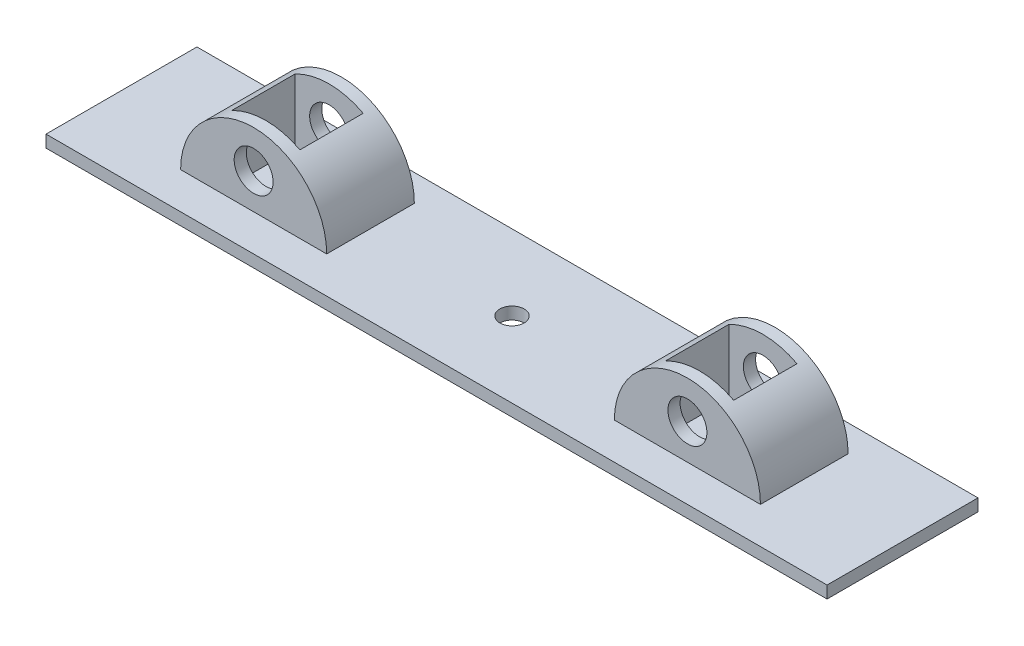
ISO-10303-21;
HEADER;
FILE_DESCRIPTION(('STEP AP214'),'2;1');
FILE_NAME('part.step','',(''),(''),'','','');
FILE_SCHEMA(('AUTOMOTIVE_DESIGN { 1 0 10303 214 1 1 1 1 }'));
ENDSEC;
DATA;
#1=APPLICATION_CONTEXT('core data for automotive mechanical design processes');
#2=APPLICATION_PROTOCOL_DEFINITION('international standard','automotive_design',2000,#1);
#3=PRODUCT_CONTEXT('',#1,'mechanical');
#4=PRODUCT('Part','Part','',(#3));
#5=PRODUCT_RELATED_PRODUCT_CATEGORY('part','',(#4));
#6=PRODUCT_DEFINITION_FORMATION('','',#4);
#7=PRODUCT_DEFINITION_CONTEXT('part definition',#1,'design');
#8=PRODUCT_DEFINITION('design','',#6,#7);
#9=PRODUCT_DEFINITION_SHAPE('','',#8);
#10=(LENGTH_UNIT() NAMED_UNIT(*) SI_UNIT(.MILLI.,.METRE.));
#11=(NAMED_UNIT(*) PLANE_ANGLE_UNIT() SI_UNIT($,.RADIAN.));
#12=(NAMED_UNIT(*) SI_UNIT($,.STERADIAN.) SOLID_ANGLE_UNIT());
#13=UNCERTAINTY_MEASURE_WITH_UNIT(LENGTH_MEASURE(1.E-05),#10,'distance_accuracy_value','');
#14=(GEOMETRIC_REPRESENTATION_CONTEXT(3) GLOBAL_UNCERTAINTY_ASSIGNED_CONTEXT((#13)) GLOBAL_UNIT_ASSIGNED_CONTEXT((#10,
#11,#12)) REPRESENTATION_CONTEXT('',''));
#15=CARTESIAN_POINT('',(0.,0.,0.));
#16=DIRECTION('',(0.,0.,1.));
#17=DIRECTION('',(1.,0.,0.));
#18=AXIS2_PLACEMENT_3D('',#15,#16,#17);
#19=CARTESIAN_POINT('',(35.1428377006438,2.5,-25.5));
#20=DIRECTION('',(0.,0.,1.));
#21=DIRECTION('',(1.,0.,0.));
#22=AXIS2_PLACEMENT_3D('',#19,#20,#21);
#23=CYLINDRICAL_SURFACE('',#22,15.);
#24=CARTESIAN_POINT('',(35.1428377006438,2.5,-7.5));
#25=DIRECTION('',(0.,0.,1.));
#26=DIRECTION('',(1.,0.,0.));
#27=AXIS2_PLACEMENT_3D('',#24,#25,#26);
#28=CIRCLE('',#27,15.);
#29=CARTESIAN_POINT('',(50.1428377006438,2.5,-7.5));
#30=VERTEX_POINT('',#29);
#31=CARTESIAN_POINT('',(20.1428377006438,2.5,-7.5));
#32=VERTEX_POINT('',#31);
#33=EDGE_CURVE('E273',#30,#32,#28,.T.);
#34=ORIENTED_EDGE('',*,*,#33,.F.);
#35=DIRECTION('',(0.,0.,1.));
#36=VECTOR('',#35,1.);
#37=CARTESIAN_POINT('',(50.1428377006438,2.5,-25.5));
#38=LINE('',#37,#36);
#39=CARTESIAN_POINT('',(50.1428377006438,2.5,-25.5));
#40=VERTEX_POINT('',#39);
#41=EDGE_CURVE('E291',#40,#30,#38,.T.);
#42=ORIENTED_EDGE('',*,*,#41,.F.);
#43=CARTESIAN_POINT('',(35.1428377006438,2.5,-25.5));
#44=DIRECTION('',(0.,0.,1.));
#45=DIRECTION('',(1.,0.,0.));
#46=AXIS2_PLACEMENT_3D('',#43,#44,#45);
#47=CIRCLE('',#46,15.);
#48=CARTESIAN_POINT('',(20.1428377006438,2.5,-25.5));
#49=VERTEX_POINT('',#48);
#50=EDGE_CURVE('E277',#40,#49,#47,.T.);
#51=ORIENTED_EDGE('',*,*,#50,.T.);
#52=DIRECTION('',(0.,0.,1.));
#53=VECTOR('',#52,1.);
#54=CARTESIAN_POINT('',(20.1428377006438,2.5,-25.5));
#55=LINE('',#54,#53);
#56=EDGE_CURVE('E285',#49,#32,#55,.T.);
#57=ORIENTED_EDGE('',*,*,#56,.T.);
#58=EDGE_LOOP('',(#34,#42,#51,#57));
#59=FACE_BOUND('',#58,.T.);
#60=CARTESIAN_POINT('',(35.1428377006438,2.5,-10.));
#61=DIRECTION('',(0.,0.,-1.));
#62=DIRECTION('',(-1.,0.,0.));
#63=AXIS2_PLACEMENT_3D('',#60,#61,#62);
#64=CIRCLE('',#63,15.);
#65=CARTESIAN_POINT('',(42.1428377006438,15.7664991614216,-10.));
#66=VERTEX_POINT('',#65);
#67=CARTESIAN_POINT('',(28.1428377006438,15.7664991614216,-10.));
#68=VERTEX_POINT('',#67);
#69=EDGE_CURVE('E235',#66,#68,#64,.F.);
#70=ORIENTED_EDGE('',*,*,#69,.T.);
#71=DIRECTION('',(0.,0.,1.));
#72=VECTOR('',#71,1.);
#73=CARTESIAN_POINT('',(28.1428377006438,15.7664991614216,-25.5));
#74=LINE('',#73,#72);
#75=CARTESIAN_POINT('',(28.1428377006438,15.7664991614216,-23.));
#76=VERTEX_POINT('',#75);
#77=EDGE_CURVE('E11',#68,#76,#74,.F.);
#78=ORIENTED_EDGE('',*,*,#77,.T.);
#79=CARTESIAN_POINT('',(35.1428377006438,2.5,-23.));
#80=DIRECTION('',(0.,0.,1.));
#81=DIRECTION('',(1.,0.,0.));
#82=AXIS2_PLACEMENT_3D('',#79,#80,#81);
#83=CIRCLE('',#82,15.);
#84=CARTESIAN_POINT('',(42.1428377006438,15.7664991614216,-23.));
#85=VERTEX_POINT('',#84);
#86=EDGE_CURVE('E230',#76,#85,#83,.F.);
#87=ORIENTED_EDGE('',*,*,#86,.T.);
#88=DIRECTION('',(0.,0.,1.));
#89=VECTOR('',#88,1.);
#90=CARTESIAN_POINT('',(42.1428377006438,15.7664991614216,-25.5));
#91=LINE('',#90,#89);
#92=EDGE_CURVE('E48',#85,#66,#91,.T.);
#93=ORIENTED_EDGE('',*,*,#92,.T.);
#94=EDGE_LOOP('',(#70,#78,#87,#93));
#95=FACE_BOUND('',#94,.T.);
#96=ADVANCED_FACE('F39',(#59,#95),#23,.T.);
#97=CARTESIAN_POINT('',(35.1428377006438,9.77291933943923,-25.5));
#98=DIRECTION('',(0.,0.,1.));
#99=DIRECTION('',(1.,0.,0.));
#100=AXIS2_PLACEMENT_3D('',#97,#98,#99);
#101=CYLINDRICAL_SURFACE('',#100,4.00000000000001);
#102=CARTESIAN_POINT('',(35.1428377006438,9.77291933943923,-7.5));
#103=DIRECTION('',(0.,0.,1.));
#104=DIRECTION('',(1.,0.,0.));
#105=AXIS2_PLACEMENT_3D('',#102,#103,#104);
#106=CIRCLE('',#105,4.00000000000001);
#107=CARTESIAN_POINT('',(39.1428377006438,9.77291933943923,-7.5));
#108=VERTEX_POINT('',#107);
#109=EDGE_CURVE('E265',#108,#108,#106,.T.);
#110=ORIENTED_EDGE('',*,*,#109,.T.);
#111=EDGE_LOOP('',(#110));
#112=FACE_BOUND('',#111,.T.);
#113=CARTESIAN_POINT('',(35.1428377006438,9.77291933943923,-10.));
#114=DIRECTION('',(0.,0.,-1.));
#115=DIRECTION('',(-1.,0.,0.));
#116=AXIS2_PLACEMENT_3D('',#113,#114,#115);
#117=CIRCLE('',#116,4.00000000000001);
#118=CARTESIAN_POINT('',(31.1428377006438,9.77291933943923,-10.));
#119=VERTEX_POINT('',#118);
#120=EDGE_CURVE('E234',#119,#119,#117,.F.);
#121=ORIENTED_EDGE('',*,*,#120,.F.);
#122=EDGE_LOOP('',(#121));
#123=FACE_BOUND('',#122,.T.);
#124=ADVANCED_FACE('F381',(#112,#123),#101,.F.);
#125=CARTESIAN_POINT('',(35.1428377006438,9.77291933943923,-25.5));
#126=DIRECTION('',(0.,0.,1.));
#127=DIRECTION('',(1.,0.,0.));
#128=AXIS2_PLACEMENT_3D('',#125,#126,#127);
#129=CIRCLE('',#128,4.00000000000001);
#130=CARTESIAN_POINT('',(39.1428377006438,9.77291933943923,-25.5));
#131=VERTEX_POINT('',#130);
#132=EDGE_CURVE('E269',#131,#131,#129,.T.);
#133=ORIENTED_EDGE('',*,*,#132,.F.);
#134=EDGE_LOOP('',(#133));
#135=FACE_BOUND('',#134,.T.);
#136=CARTESIAN_POINT('',(35.1428377006438,9.77291933943923,-23.));
#137=DIRECTION('',(0.,0.,1.));
#138=DIRECTION('',(1.,0.,0.));
#139=AXIS2_PLACEMENT_3D('',#136,#137,#138);
#140=CIRCLE('',#139,4.00000000000001);
#141=CARTESIAN_POINT('',(39.1428377006438,9.77291933943923,-23.));
#142=VERTEX_POINT('',#141);
#143=EDGE_CURVE('E229',#142,#142,#140,.F.);
#144=ORIENTED_EDGE('',*,*,#143,.F.);
#145=EDGE_LOOP('',(#144));
#146=FACE_BOUND('',#145,.T.);
#147=ADVANCED_FACE('F378',(#135,#146),#101,.F.);
#148=CARTESIAN_POINT('',(124.223811869943,2.5,-25.5));
#149=DIRECTION('',(0.,0.,1.));
#150=DIRECTION('',(1.,0.,0.));
#151=AXIS2_PLACEMENT_3D('',#148,#149,#150);
#152=CYLINDRICAL_SURFACE('',#151,15.);
#153=CARTESIAN_POINT('',(124.223811869943,2.5,-7.5));
#154=DIRECTION('',(0.,0.,1.));
#155=DIRECTION('',(1.,0.,0.));
#156=AXIS2_PLACEMENT_3D('',#153,#154,#155);
#157=CIRCLE('',#156,15.);
#158=CARTESIAN_POINT('',(139.223811869943,2.5,-7.5));
#159=VERTEX_POINT('',#158);
#160=CARTESIAN_POINT('',(109.223811869943,2.5,-7.5));
#161=VERTEX_POINT('',#160);
#162=EDGE_CURVE('E243',#159,#161,#157,.T.);
#163=ORIENTED_EDGE('',*,*,#162,.F.);
#164=DIRECTION('',(0.,0.,1.));
#165=VECTOR('',#164,1.);
#166=CARTESIAN_POINT('',(139.223811869943,2.5,-25.5));
#167=LINE('',#166,#165);
#168=CARTESIAN_POINT('',(139.223811869943,2.5,-25.5));
#169=VERTEX_POINT('',#168);
#170=EDGE_CURVE('E261',#169,#159,#167,.T.);
#171=ORIENTED_EDGE('',*,*,#170,.F.);
#172=CARTESIAN_POINT('',(124.223811869943,2.5,-25.5));
#173=DIRECTION('',(0.,0.,1.));
#174=DIRECTION('',(1.,0.,0.));
#175=AXIS2_PLACEMENT_3D('',#172,#173,#174);
#176=CIRCLE('',#175,15.);
#177=CARTESIAN_POINT('',(109.223811869943,2.5,-25.5));
#178=VERTEX_POINT('',#177);
#179=EDGE_CURVE('E247',#169,#178,#176,.T.);
#180=ORIENTED_EDGE('',*,*,#179,.T.);
#181=DIRECTION('',(0.,0.,1.));
#182=VECTOR('',#181,1.);
#183=CARTESIAN_POINT('',(109.223811869943,2.5,-25.5));
#184=LINE('',#183,#182);
#185=EDGE_CURVE('E255',#178,#161,#184,.T.);
#186=ORIENTED_EDGE('',*,*,#185,.T.);
#187=EDGE_LOOP('',(#163,#171,#180,#186));
#188=FACE_BOUND('',#187,.T.);
#189=CARTESIAN_POINT('',(124.223811869943,2.5,-10.));
#190=DIRECTION('',(0.,0.,-1.));
#191=DIRECTION('',(-1.,0.,0.));
#192=AXIS2_PLACEMENT_3D('',#189,#190,#191);
#193=CIRCLE('',#192,15.);
#194=CARTESIAN_POINT('',(131.223811869943,15.7664991614216,-10.));
#195=VERTEX_POINT('',#194);
#196=CARTESIAN_POINT('',(117.223811869943,15.7664991614216,-10.));
#197=VERTEX_POINT('',#196);
#198=EDGE_CURVE('E225',#195,#197,#193,.F.);
#199=ORIENTED_EDGE('',*,*,#198,.T.);
#200=DIRECTION('',(0.,0.,1.));
#201=VECTOR('',#200,1.);
#202=CARTESIAN_POINT('',(117.223811869943,15.7664991614216,-25.5));
#203=LINE('',#202,#201);
#204=CARTESIAN_POINT('',(117.223811869943,15.7664991614216,-23.));
#205=VERTEX_POINT('',#204);
#206=EDGE_CURVE('E358',#197,#205,#203,.F.);
#207=ORIENTED_EDGE('',*,*,#206,.T.);
#208=CARTESIAN_POINT('',(124.223811869943,2.5,-23.));
#209=DIRECTION('',(0.,0.,1.));
#210=DIRECTION('',(1.,0.,0.));
#211=AXIS2_PLACEMENT_3D('',#208,#209,#210);
#212=CIRCLE('',#211,15.);
#213=CARTESIAN_POINT('',(131.223811869943,15.7664991614216,-23.));
#214=VERTEX_POINT('',#213);
#215=EDGE_CURVE('E220',#205,#214,#212,.F.);
#216=ORIENTED_EDGE('',*,*,#215,.T.);
#217=DIRECTION('',(0.,0.,1.));
#218=VECTOR('',#217,1.);
#219=CARTESIAN_POINT('',(131.223811869943,15.7664991614216,-25.5));
#220=LINE('',#219,#218);
#221=EDGE_CURVE('E348',#214,#195,#220,.T.);
#222=ORIENTED_EDGE('',*,*,#221,.T.);
#223=EDGE_LOOP('',(#199,#207,#216,#222));
#224=FACE_BOUND('',#223,.T.);
#225=ADVANCED_FACE('F380',(#188,#224),#152,.T.);
#226=CARTESIAN_POINT('',(124.223811869943,9.77291933943923,-25.5));
#227=DIRECTION('',(0.,0.,1.));
#228=DIRECTION('',(1.,0.,0.));
#229=AXIS2_PLACEMENT_3D('',#226,#227,#228);
#230=CYLINDRICAL_SURFACE('',#229,3.99999999999998);
#231=CARTESIAN_POINT('',(124.223811869943,9.77291933943923,-7.5));
#232=DIRECTION('',(0.,0.,1.));
#233=DIRECTION('',(1.,0.,0.));
#234=AXIS2_PLACEMENT_3D('',#231,#232,#233);
#235=CIRCLE('',#234,3.99999999999998);
#236=CARTESIAN_POINT('',(128.223811869943,9.77291933943923,-7.5));
#237=VERTEX_POINT('',#236);
#238=EDGE_CURVE('E238',#237,#237,#235,.T.);
#239=ORIENTED_EDGE('',*,*,#238,.T.);
#240=EDGE_LOOP('',(#239));
#241=FACE_BOUND('',#240,.T.);
#242=CARTESIAN_POINT('',(124.223811869943,9.77291933943923,-10.));
#243=DIRECTION('',(0.,0.,-1.));
#244=DIRECTION('',(-1.,0.,0.));
#245=AXIS2_PLACEMENT_3D('',#242,#243,#244);
#246=CIRCLE('',#245,3.99999999999998);
#247=CARTESIAN_POINT('',(120.223811869943,9.77291933943923,-10.));
#248=VERTEX_POINT('',#247);
#249=EDGE_CURVE('E224',#248,#248,#246,.F.);
#250=ORIENTED_EDGE('',*,*,#249,.F.);
#251=EDGE_LOOP('',(#250));
#252=FACE_BOUND('',#251,.T.);
#253=ADVANCED_FACE('F388',(#241,#252),#230,.F.);
#254=CARTESIAN_POINT('',(124.223811869943,9.77291933943923,-25.5));
#255=DIRECTION('',(0.,0.,1.));
#256=DIRECTION('',(1.,0.,0.));
#257=AXIS2_PLACEMENT_3D('',#254,#255,#256);
#258=CIRCLE('',#257,3.99999999999998);
#259=CARTESIAN_POINT('',(128.223811869943,9.77291933943923,-25.5));
#260=VERTEX_POINT('',#259);
#261=EDGE_CURVE('E239',#260,#260,#258,.T.);
#262=ORIENTED_EDGE('',*,*,#261,.F.);
#263=EDGE_LOOP('',(#262));
#264=FACE_BOUND('',#263,.T.);
#265=CARTESIAN_POINT('',(124.223811869943,9.77291933943923,-23.));
#266=DIRECTION('',(0.,0.,1.));
#267=DIRECTION('',(1.,0.,0.));
#268=AXIS2_PLACEMENT_3D('',#265,#266,#267);
#269=CIRCLE('',#268,3.99999999999998);
#270=CARTESIAN_POINT('',(128.223811869943,9.77291933943923,-23.));
#271=VERTEX_POINT('',#270);
#272=EDGE_CURVE('E162',#271,#271,#269,.F.);
#273=ORIENTED_EDGE('',*,*,#272,.F.);
#274=EDGE_LOOP('',(#273));
#275=FACE_BOUND('',#274,.T.);
#276=ADVANCED_FACE('F412',(#264,#275),#230,.F.);
#277=CARTESIAN_POINT('',(0.,2.5,0.));
#278=DIRECTION('',(0.,-1.,0.));
#279=DIRECTION('',(0.,0.,-1.));
#280=AXIS2_PLACEMENT_3D('',#277,#278,#279);
#281=PLANE('',#280);
#282=DIRECTION('',(1.,0.,0.));
#283=VECTOR('',#282,1.);
#284=CARTESIAN_POINT('',(20.1428377006438,2.5,-25.5));
#285=LINE('',#284,#283);
#286=EDGE_CURVE('E280',#49,#40,#285,.T.);
#287=ORIENTED_EDGE('',*,*,#286,.T.);
#288=ORIENTED_EDGE('',*,*,#41,.T.);
#289=DIRECTION('',(1.,0.,0.));
#290=VECTOR('',#289,1.);
#291=CARTESIAN_POINT('',(20.1428377006438,2.5,-7.5));
#292=LINE('',#291,#290);
#293=EDGE_CURVE('E281',#32,#30,#292,.T.);
#294=ORIENTED_EDGE('',*,*,#293,.F.);
#295=ORIENTED_EDGE('',*,*,#56,.F.);
#296=EDGE_LOOP('',(#287,#288,#294,#295));
#297=FACE_BOUND('',#296,.T.);
#298=DIRECTION('',(0.,0.,1.));
#299=VECTOR('',#298,1.);
#300=CARTESIAN_POINT('',(0.,2.5,0.));
#301=LINE('',#300,#299);
#302=CARTESIAN_POINT('',(0.,2.5,-31.));
#303=VERTEX_POINT('',#302);
#304=CARTESIAN_POINT('',(0.,2.5,0.));
#305=VERTEX_POINT('',#304);
#306=EDGE_CURVE('E307',#303,#305,#301,.T.);
#307=ORIENTED_EDGE('',*,*,#306,.T.);
#308=DIRECTION('',(1.,0.,0.));
#309=VECTOR('',#308,1.);
#310=CARTESIAN_POINT('',(0.,2.5,0.));
#311=LINE('',#310,#309);
#312=CARTESIAN_POINT('',(160.4,2.5,0.));
#313=VERTEX_POINT('',#312);
#314=EDGE_CURVE('E311',#305,#313,#311,.T.);
#315=ORIENTED_EDGE('',*,*,#314,.T.);
#316=DIRECTION('',(0.,0.,-1.));
#317=VECTOR('',#316,1.);
#318=CARTESIAN_POINT('',(160.4,2.5,0.));
#319=LINE('',#318,#317);
#320=CARTESIAN_POINT('',(160.4,2.5,-31.));
#321=VERTEX_POINT('',#320);
#322=EDGE_CURVE('E315',#313,#321,#319,.T.);
#323=ORIENTED_EDGE('',*,*,#322,.T.);
#324=DIRECTION('',(-1.,0.,0.));
#325=VECTOR('',#324,1.);
#326=CARTESIAN_POINT('',(0.,2.5,-31.));
#327=LINE('',#326,#325);
#328=EDGE_CURVE('E318',#321,#303,#327,.T.);
#329=ORIENTED_EDGE('',*,*,#328,.T.);
#330=EDGE_LOOP('',(#307,#315,#323,#329));
#331=FACE_BOUND('',#330,.T.);
#332=CARTESIAN_POINT('',(80.2,2.5,-15.5));
#333=DIRECTION('',(0.,1.,0.));
#334=DIRECTION('',(0.,0.,1.));
#335=AXIS2_PLACEMENT_3D('',#332,#333,#334);
#336=CIRCLE('',#335,2.50000000000001);
#337=CARTESIAN_POINT('',(80.2,2.5,-13.));
#338=VERTEX_POINT('',#337);
#339=EDGE_CURVE('E299',#338,#338,#336,.T.);
#340=ORIENTED_EDGE('',*,*,#339,.F.);
#341=EDGE_LOOP('',(#340));
#342=FACE_BOUND('',#341,.T.);
#343=DIRECTION('',(1.,0.,0.));
#344=VECTOR('',#343,1.);
#345=CARTESIAN_POINT('',(109.223811869943,2.5,-25.5));
#346=LINE('',#345,#344);
#347=EDGE_CURVE('E250',#178,#169,#346,.T.);
#348=ORIENTED_EDGE('',*,*,#347,.T.);
#349=ORIENTED_EDGE('',*,*,#170,.T.);
#350=DIRECTION('',(1.,0.,0.));
#351=VECTOR('',#350,1.);
#352=CARTESIAN_POINT('',(109.223811869943,2.5,-7.5));
#353=LINE('',#352,#351);
#354=EDGE_CURVE('E251',#161,#159,#353,.T.);
#355=ORIENTED_EDGE('',*,*,#354,.F.);
#356=ORIENTED_EDGE('',*,*,#185,.F.);
#357=EDGE_LOOP('',(#348,#349,#355,#356));
#358=FACE_BOUND('',#357,.T.);
#359=ADVANCED_FACE('F408',(#297,#331,#342,#358),#281,.F.);
#360=CARTESIAN_POINT('',(0.,0.,0.));
#361=DIRECTION('',(0.,-1.,0.));
#362=DIRECTION('',(0.,0.,-1.));
#363=AXIS2_PLACEMENT_3D('',#360,#361,#362);
#364=PLANE('',#363);
#365=DIRECTION('',(0.,0.,1.));
#366=VECTOR('',#365,1.);
#367=CARTESIAN_POINT('',(0.,0.,0.));
#368=LINE('',#367,#366);
#369=CARTESIAN_POINT('',(0.,0.,-31.));
#370=VERTEX_POINT('',#369);
#371=CARTESIAN_POINT('',(0.,0.,0.));
#372=VERTEX_POINT('',#371);
#373=EDGE_CURVE('E303',#370,#372,#368,.T.);
#374=ORIENTED_EDGE('',*,*,#373,.F.);
#375=DIRECTION('',(-1.,0.,0.));
#376=VECTOR('',#375,1.);
#377=CARTESIAN_POINT('',(0.,0.,-31.));
#378=LINE('',#377,#376);
#379=CARTESIAN_POINT('',(160.4,0.,-31.));
#380=VERTEX_POINT('',#379);
#381=EDGE_CURVE('E312',#380,#370,#378,.T.);
#382=ORIENTED_EDGE('',*,*,#381,.F.);
#383=DIRECTION('',(0.,0.,-1.));
#384=VECTOR('',#383,1.);
#385=CARTESIAN_POINT('',(160.4,0.,0.));
#386=LINE('',#385,#384);
#387=CARTESIAN_POINT('',(160.4,0.,0.));
#388=VERTEX_POINT('',#387);
#389=EDGE_CURVE('E328',#388,#380,#386,.T.);
#390=ORIENTED_EDGE('',*,*,#389,.F.);
#391=DIRECTION('',(1.,0.,0.));
#392=VECTOR('',#391,1.);
#393=CARTESIAN_POINT('',(0.,0.,0.));
#394=LINE('',#393,#392);
#395=EDGE_CURVE('E325',#372,#388,#394,.T.);
#396=ORIENTED_EDGE('',*,*,#395,.F.);
#397=EDGE_LOOP('',(#374,#382,#390,#396));
#398=FACE_BOUND('',#397,.T.);
#399=CARTESIAN_POINT('',(80.2,0.,-15.5));
#400=DIRECTION('',(0.,1.,0.));
#401=DIRECTION('',(0.,0.,1.));
#402=AXIS2_PLACEMENT_3D('',#399,#400,#401);
#403=CIRCLE('',#402,2.50000000000001);
#404=CARTESIAN_POINT('',(80.2,0.,-13.));
#405=VERTEX_POINT('',#404);
#406=EDGE_CURVE('E295',#405,#405,#403,.T.);
#407=ORIENTED_EDGE('',*,*,#406,.T.);
#408=EDGE_LOOP('',(#407));
#409=FACE_BOUND('',#408,.T.);
#410=ADVANCED_FACE('F411',(#398,#409),#364,.T.);
#411=CARTESIAN_POINT('',(0.,2.5,0.));
#412=DIRECTION('',(1.,0.,0.));
#413=DIRECTION('',(0.,0.,-1.));
#414=AXIS2_PLACEMENT_3D('',#411,#412,#413);
#415=PLANE('',#414);
#416=ORIENTED_EDGE('',*,*,#373,.T.);
#417=DIRECTION('',(0.,-1.,0.));
#418=VECTOR('',#417,1.);
#419=CARTESIAN_POINT('',(0.,2.5,0.));
#420=LINE('',#419,#418);
#421=EDGE_CURVE('E344',#305,#372,#420,.T.);
#422=ORIENTED_EDGE('',*,*,#421,.F.);
#423=ORIENTED_EDGE('',*,*,#306,.F.);
#424=DIRECTION('',(0.,-1.,0.));
#425=VECTOR('',#424,1.);
#426=CARTESIAN_POINT('',(0.,2.5,-31.));
#427=LINE('',#426,#425);
#428=EDGE_CURVE('E321',#303,#370,#427,.T.);
#429=ORIENTED_EDGE('',*,*,#428,.T.);
#430=EDGE_LOOP('',(#416,#422,#423,#429));
#431=FACE_BOUND('',#430,.T.);
#432=ADVANCED_FACE('F41',(#431),#415,.F.);
#433=CARTESIAN_POINT('',(0.,2.5,0.));
#434=DIRECTION('',(0.,0.,-1.));
#435=DIRECTION('',(-1.,0.,0.));
#436=AXIS2_PLACEMENT_3D('',#433,#434,#435);
#437=PLANE('',#436);
#438=ORIENTED_EDGE('',*,*,#395,.T.);
#439=DIRECTION('',(0.,-1.,0.));
#440=VECTOR('',#439,1.);
#441=CARTESIAN_POINT('',(160.4,2.5,0.));
#442=LINE('',#441,#440);
#443=EDGE_CURVE('E340',#313,#388,#442,.T.);
#444=ORIENTED_EDGE('',*,*,#443,.F.);
#445=ORIENTED_EDGE('',*,*,#314,.F.);
#446=ORIENTED_EDGE('',*,*,#421,.T.);
#447=EDGE_LOOP('',(#438,#444,#445,#446));
#448=FACE_BOUND('',#447,.T.);
#449=ADVANCED_FACE('F422',(#448),#437,.F.);
#450=CARTESIAN_POINT('',(160.4,2.5,0.));
#451=DIRECTION('',(-1.,0.,0.));
#452=DIRECTION('',(0.,0.,1.));
#453=AXIS2_PLACEMENT_3D('',#450,#451,#452);
#454=PLANE('',#453);
#455=ORIENTED_EDGE('',*,*,#389,.T.);
#456=DIRECTION('',(0.,-1.,0.));
#457=VECTOR('',#456,1.);
#458=CARTESIAN_POINT('',(160.4,2.5,-31.));
#459=LINE('',#458,#457);
#460=EDGE_CURVE('E336',#321,#380,#459,.T.);
#461=ORIENTED_EDGE('',*,*,#460,.F.);
#462=ORIENTED_EDGE('',*,*,#322,.F.);
#463=ORIENTED_EDGE('',*,*,#443,.T.);
#464=EDGE_LOOP('',(#455,#461,#462,#463));
#465=FACE_BOUND('',#464,.T.);
#466=ADVANCED_FACE('F419',(#465),#454,.F.);
#467=CARTESIAN_POINT('',(0.,2.5,-31.));
#468=DIRECTION('',(0.,0.,1.));
#469=DIRECTION('',(1.,0.,0.));
#470=AXIS2_PLACEMENT_3D('',#467,#468,#469);
#471=PLANE('',#470);
#472=ORIENTED_EDGE('',*,*,#381,.T.);
#473=ORIENTED_EDGE('',*,*,#428,.F.);
#474=ORIENTED_EDGE('',*,*,#328,.F.);
#475=ORIENTED_EDGE('',*,*,#460,.T.);
#476=EDGE_LOOP('',(#472,#473,#474,#475));
#477=FACE_BOUND('',#476,.T.);
#478=ADVANCED_FACE('F406',(#477),#471,.F.);
#479=CARTESIAN_POINT('',(80.2,2.5,-15.5));
#480=DIRECTION('',(0.,-1.,0.));
#481=DIRECTION('',(0.,0.,-1.));
#482=AXIS2_PLACEMENT_3D('',#479,#480,#481);
#483=CYLINDRICAL_SURFACE('',#482,2.50000000000001);
#484=ORIENTED_EDGE('',*,*,#339,.T.);
#485=EDGE_LOOP('',(#484));
#486=FACE_BOUND('',#485,.T.);
#487=ORIENTED_EDGE('',*,*,#406,.F.);
#488=EDGE_LOOP('',(#487));
#489=FACE_BOUND('',#488,.T.);
#490=ADVANCED_FACE('F402',(#486,#489),#483,.F.);
#491=CARTESIAN_POINT('',(35.1428377006438,2.5,-25.5));
#492=DIRECTION('',(0.,0.,1.));
#493=DIRECTION('',(1.,0.,0.));
#494=AXIS2_PLACEMENT_3D('',#491,#492,#493);
#495=PLANE('',#494);
#496=ORIENTED_EDGE('',*,*,#132,.T.);
#497=EDGE_LOOP('',(#496));
#498=FACE_BOUND('',#497,.T.);
#499=ORIENTED_EDGE('',*,*,#50,.F.);
#500=ORIENTED_EDGE('',*,*,#286,.F.);
#501=EDGE_LOOP('',(#499,#500));
#502=FACE_BOUND('',#501,.T.);
#503=ADVANCED_FACE('F405',(#498,#502),#495,.F.);
#504=CARTESIAN_POINT('',(35.1428377006438,2.5,-7.5));
#505=DIRECTION('',(0.,0.,1.));
#506=DIRECTION('',(1.,0.,0.));
#507=AXIS2_PLACEMENT_3D('',#504,#505,#506);
#508=PLANE('',#507);
#509=ORIENTED_EDGE('',*,*,#109,.F.);
#510=EDGE_LOOP('',(#509));
#511=FACE_BOUND('',#510,.T.);
#512=ORIENTED_EDGE('',*,*,#33,.T.);
#513=ORIENTED_EDGE('',*,*,#293,.T.);
#514=EDGE_LOOP('',(#512,#513));
#515=FACE_BOUND('',#514,.T.);
#516=ADVANCED_FACE('F401',(#511,#515),#508,.T.);
#517=CARTESIAN_POINT('',(124.223811869943,2.5,-25.5));
#518=DIRECTION('',(0.,0.,1.));
#519=DIRECTION('',(1.,0.,0.));
#520=AXIS2_PLACEMENT_3D('',#517,#518,#519);
#521=PLANE('',#520);
#522=ORIENTED_EDGE('',*,*,#261,.T.);
#523=EDGE_LOOP('',(#522));
#524=FACE_BOUND('',#523,.T.);
#525=ORIENTED_EDGE('',*,*,#179,.F.);
#526=ORIENTED_EDGE('',*,*,#347,.F.);
#527=EDGE_LOOP('',(#525,#526));
#528=FACE_BOUND('',#527,.T.);
#529=ADVANCED_FACE('F450',(#524,#528),#521,.F.);
#530=CARTESIAN_POINT('',(124.223811869943,2.5,-7.5));
#531=DIRECTION('',(0.,0.,1.));
#532=DIRECTION('',(1.,0.,0.));
#533=AXIS2_PLACEMENT_3D('',#530,#531,#532);
#534=PLANE('',#533);
#535=ORIENTED_EDGE('',*,*,#238,.F.);
#536=EDGE_LOOP('',(#535));
#537=FACE_BOUND('',#536,.T.);
#538=ORIENTED_EDGE('',*,*,#162,.T.);
#539=ORIENTED_EDGE('',*,*,#354,.T.);
#540=EDGE_LOOP('',(#538,#539));
#541=FACE_BOUND('',#540,.T.);
#542=ADVANCED_FACE('F453',(#537,#541),#534,.T.);
#543=CARTESIAN_POINT('',(117.223811869943,20.5,-10.));
#544=DIRECTION('',(0.,0.,-1.));
#545=DIRECTION('',(-1.,0.,0.));
#546=AXIS2_PLACEMENT_3D('',#543,#544,#545);
#547=PLANE('',#546);
#548=DIRECTION('',(0.,-1.,0.));
#549=VECTOR('',#548,1.);
#550=CARTESIAN_POINT('',(131.223811869943,20.5,-10.));
#551=LINE('',#550,#549);
#552=CARTESIAN_POINT('',(131.223811869943,2.5,-10.));
#553=VERTEX_POINT('',#552);
#554=EDGE_CURVE('E183',#195,#553,#551,.T.);
#555=ORIENTED_EDGE('',*,*,#554,.T.);
#556=DIRECTION('',(1.,0.,0.));
#557=VECTOR('',#556,1.);
#558=CARTESIAN_POINT('',(117.223811869943,2.5,-10.));
#559=LINE('',#558,#557);
#560=CARTESIAN_POINT('',(117.223811869943,2.5,-10.));
#561=VERTEX_POINT('',#560);
#562=EDGE_CURVE('E201',#561,#553,#559,.T.);
#563=ORIENTED_EDGE('',*,*,#562,.F.);
#564=DIRECTION('',(0.,-1.,0.));
#565=VECTOR('',#564,1.);
#566=CARTESIAN_POINT('',(117.223811869943,20.5,-10.));
#567=LINE('',#566,#565);
#568=EDGE_CURVE('E180',#197,#561,#567,.T.);
#569=ORIENTED_EDGE('',*,*,#568,.F.);
#570=ORIENTED_EDGE('',*,*,#198,.F.);
#571=EDGE_LOOP('',(#555,#563,#569,#570));
#572=FACE_BOUND('',#571,.T.);
#573=ORIENTED_EDGE('',*,*,#249,.T.);
#574=EDGE_LOOP('',(#573));
#575=FACE_BOUND('',#574,.T.);
#576=ADVANCED_FACE('F455',(#572,#575),#547,.T.);
#577=CARTESIAN_POINT('',(117.223811869943,20.5,-23.));
#578=DIRECTION('',(0.,0.,1.));
#579=DIRECTION('',(1.,0.,0.));
#580=AXIS2_PLACEMENT_3D('',#577,#578,#579);
#581=PLANE('',#580);
#582=DIRECTION('',(0.,-1.,0.));
#583=VECTOR('',#582,1.);
#584=CARTESIAN_POINT('',(117.223811869943,20.5,-23.));
#585=LINE('',#584,#583);
#586=CARTESIAN_POINT('',(117.223811869943,2.5,-23.));
#587=VERTEX_POINT('',#586);
#588=EDGE_CURVE('E213',#205,#587,#585,.T.);
#589=ORIENTED_EDGE('',*,*,#588,.T.);
#590=DIRECTION('',(-1.,0.,0.));
#591=VECTOR('',#590,1.);
#592=CARTESIAN_POINT('',(117.223811869943,2.5,-23.));
#593=LINE('',#592,#591);
#594=CARTESIAN_POINT('',(131.223811869943,2.5,-23.));
#595=VERTEX_POINT('',#594);
#596=EDGE_CURVE('E209',#595,#587,#593,.T.);
#597=ORIENTED_EDGE('',*,*,#596,.F.);
#598=DIRECTION('',(0.,-1.,0.));
#599=VECTOR('',#598,1.);
#600=CARTESIAN_POINT('',(131.223811869943,20.5,-23.));
#601=LINE('',#600,#599);
#602=EDGE_CURVE('E63',#214,#595,#601,.T.);
#603=ORIENTED_EDGE('',*,*,#602,.F.);
#604=ORIENTED_EDGE('',*,*,#215,.F.);
#605=EDGE_LOOP('',(#589,#597,#603,#604));
#606=FACE_BOUND('',#605,.T.);
#607=ORIENTED_EDGE('',*,*,#272,.T.);
#608=EDGE_LOOP('',(#607));
#609=FACE_BOUND('',#608,.T.);
#610=ADVANCED_FACE('F462',(#606,#609),#581,.T.);
#611=CARTESIAN_POINT('',(117.223811869943,20.5,-23.));
#612=DIRECTION('',(1.,0.,0.));
#613=DIRECTION('',(0.,0.,-1.));
#614=AXIS2_PLACEMENT_3D('',#611,#612,#613);
#615=PLANE('',#614);
#616=ORIENTED_EDGE('',*,*,#568,.T.);
#617=DIRECTION('',(0.,0.,1.));
#618=VECTOR('',#617,1.);
#619=CARTESIAN_POINT('',(117.223811869943,2.5,-23.));
#620=LINE('',#619,#618);
#621=EDGE_CURVE('E197',#587,#561,#620,.T.);
#622=ORIENTED_EDGE('',*,*,#621,.F.);
#623=ORIENTED_EDGE('',*,*,#588,.F.);
#624=ORIENTED_EDGE('',*,*,#206,.F.);
#625=EDGE_LOOP('',(#616,#622,#623,#624));
#626=FACE_BOUND('',#625,.T.);
#627=ADVANCED_FACE('F472',(#626),#615,.T.);
#628=CARTESIAN_POINT('',(131.223811869943,20.5,-23.));
#629=DIRECTION('',(-1.,0.,0.));
#630=DIRECTION('',(0.,0.,1.));
#631=AXIS2_PLACEMENT_3D('',#628,#629,#630);
#632=PLANE('',#631);
#633=ORIENTED_EDGE('',*,*,#602,.T.);
#634=DIRECTION('',(0.,0.,-1.));
#635=VECTOR('',#634,1.);
#636=CARTESIAN_POINT('',(131.223811869943,2.5,-23.));
#637=LINE('',#636,#635);
#638=EDGE_CURVE('E205',#553,#595,#637,.T.);
#639=ORIENTED_EDGE('',*,*,#638,.F.);
#640=ORIENTED_EDGE('',*,*,#554,.F.);
#641=ORIENTED_EDGE('',*,*,#221,.F.);
#642=EDGE_LOOP('',(#633,#639,#640,#641));
#643=FACE_BOUND('',#642,.T.);
#644=ADVANCED_FACE('F474',(#643),#632,.T.);
#645=CARTESIAN_POINT('',(0.,2.5,0.));
#646=DIRECTION('',(0.,1.,0.));
#647=DIRECTION('',(0.,0.,1.));
#648=AXIS2_PLACEMENT_3D('',#645,#646,#647);
#649=PLANE('',#648);
#650=ORIENTED_EDGE('',*,*,#621,.T.);
#651=ORIENTED_EDGE('',*,*,#562,.T.);
#652=ORIENTED_EDGE('',*,*,#638,.T.);
#653=ORIENTED_EDGE('',*,*,#596,.T.);
#654=EDGE_LOOP('',(#650,#651,#652,#653));
#655=FACE_BOUND('',#654,.T.);
#656=ADVANCED_FACE('F479',(#655),#649,.T.);
#657=CARTESIAN_POINT('',(28.1428377006438,20.5,-10.));
#658=DIRECTION('',(0.,0.,-1.));
#659=DIRECTION('',(-1.,0.,0.));
#660=AXIS2_PLACEMENT_3D('',#657,#658,#659);
#661=PLANE('',#660);
#662=DIRECTION('',(0.,-1.,0.));
#663=VECTOR('',#662,1.);
#664=CARTESIAN_POINT('',(42.1428377006438,20.5,-10.));
#665=LINE('',#664,#663);
#666=CARTESIAN_POINT('',(42.1428377006438,2.5,-10.));
#667=VERTEX_POINT('',#666);
#668=EDGE_CURVE('E163',#66,#667,#665,.T.);
#669=ORIENTED_EDGE('',*,*,#668,.T.);
#670=DIRECTION('',(1.,0.,0.));
#671=VECTOR('',#670,1.);
#672=CARTESIAN_POINT('',(28.1428377006438,2.5,-10.));
#673=LINE('',#672,#671);
#674=CARTESIAN_POINT('',(28.1428377006438,2.5,-10.));
#675=VERTEX_POINT('',#674);
#676=EDGE_CURVE('E166',#675,#667,#673,.T.);
#677=ORIENTED_EDGE('',*,*,#676,.F.);
#678=DIRECTION('',(0.,-1.,0.));
#679=VECTOR('',#678,1.);
#680=CARTESIAN_POINT('',(28.1428377006438,20.5,-10.));
#681=LINE('',#680,#679);
#682=EDGE_CURVE('E153',#68,#675,#681,.T.);
#683=ORIENTED_EDGE('',*,*,#682,.F.);
#684=ORIENTED_EDGE('',*,*,#69,.F.);
#685=EDGE_LOOP('',(#669,#677,#683,#684));
#686=FACE_BOUND('',#685,.T.);
#687=ORIENTED_EDGE('',*,*,#120,.T.);
#688=EDGE_LOOP('',(#687));
#689=FACE_BOUND('',#688,.T.);
#690=ADVANCED_FACE('F167',(#686,#689),#661,.T.);
#691=CARTESIAN_POINT('',(28.1428377006438,20.5,-23.));
#692=DIRECTION('',(0.,0.,1.));
#693=DIRECTION('',(1.,0.,0.));
#694=AXIS2_PLACEMENT_3D('',#691,#692,#693);
#695=PLANE('',#694);
#696=DIRECTION('',(0.,-1.,0.));
#697=VECTOR('',#696,1.);
#698=CARTESIAN_POINT('',(28.1428377006438,20.5,-23.));
#699=LINE('',#698,#697);
#700=CARTESIAN_POINT('',(28.1428377006438,2.5,-23.));
#701=VERTEX_POINT('',#700);
#702=EDGE_CURVE('E190',#76,#701,#699,.T.);
#703=ORIENTED_EDGE('',*,*,#702,.T.);
#704=DIRECTION('',(-1.,0.,0.));
#705=VECTOR('',#704,1.);
#706=CARTESIAN_POINT('',(28.1428377006438,2.5,-23.));
#707=LINE('',#706,#705);
#708=CARTESIAN_POINT('',(42.1428377006438,2.5,-23.));
#709=VERTEX_POINT('',#708);
#710=EDGE_CURVE('E178',#709,#701,#707,.T.);
#711=ORIENTED_EDGE('',*,*,#710,.F.);
#712=DIRECTION('',(0.,-1.,0.));
#713=VECTOR('',#712,1.);
#714=CARTESIAN_POINT('',(42.1428377006438,20.5,-23.));
#715=LINE('',#714,#713);
#716=EDGE_CURVE('E55',#85,#709,#715,.T.);
#717=ORIENTED_EDGE('',*,*,#716,.F.);
#718=ORIENTED_EDGE('',*,*,#86,.F.);
#719=EDGE_LOOP('',(#703,#711,#717,#718));
#720=FACE_BOUND('',#719,.T.);
#721=ORIENTED_EDGE('',*,*,#143,.T.);
#722=EDGE_LOOP('',(#721));
#723=FACE_BOUND('',#722,.T.);
#724=ADVANCED_FACE('F372',(#720,#723),#695,.T.);
#725=CARTESIAN_POINT('',(28.1428377006438,20.5,-23.));
#726=DIRECTION('',(1.,0.,0.));
#727=DIRECTION('',(0.,0.,-1.));
#728=AXIS2_PLACEMENT_3D('',#725,#726,#727);
#729=PLANE('',#728);
#730=ORIENTED_EDGE('',*,*,#682,.T.);
#731=DIRECTION('',(0.,0.,1.));
#732=VECTOR('',#731,1.);
#733=CARTESIAN_POINT('',(28.1428377006438,2.5,-23.));
#734=LINE('',#733,#732);
#735=EDGE_CURVE('E158',#701,#675,#734,.T.);
#736=ORIENTED_EDGE('',*,*,#735,.F.);
#737=ORIENTED_EDGE('',*,*,#702,.F.);
#738=ORIENTED_EDGE('',*,*,#77,.F.);
#739=EDGE_LOOP('',(#730,#736,#737,#738));
#740=FACE_BOUND('',#739,.T.);
#741=ADVANCED_FACE('F155',(#740),#729,.T.);
#742=CARTESIAN_POINT('',(42.1428377006438,20.5,-23.));
#743=DIRECTION('',(-1.,0.,0.));
#744=DIRECTION('',(0.,0.,1.));
#745=AXIS2_PLACEMENT_3D('',#742,#743,#744);
#746=PLANE('',#745);
#747=ORIENTED_EDGE('',*,*,#716,.T.);
#748=DIRECTION('',(0.,0.,-1.));
#749=VECTOR('',#748,1.);
#750=CARTESIAN_POINT('',(42.1428377006438,2.5,-23.));
#751=LINE('',#750,#749);
#752=EDGE_CURVE('E174',#667,#709,#751,.T.);
#753=ORIENTED_EDGE('',*,*,#752,.F.);
#754=ORIENTED_EDGE('',*,*,#668,.F.);
#755=ORIENTED_EDGE('',*,*,#92,.F.);
#756=EDGE_LOOP('',(#747,#753,#754,#755));
#757=FACE_BOUND('',#756,.T.);
#758=ADVANCED_FACE('F371',(#757),#746,.T.);
#759=CARTESIAN_POINT('',(0.,2.5,0.));
#760=DIRECTION('',(0.,1.,0.));
#761=DIRECTION('',(0.,0.,1.));
#762=AXIS2_PLACEMENT_3D('',#759,#760,#761);
#763=PLANE('',#762);
#764=ORIENTED_EDGE('',*,*,#735,.T.);
#765=ORIENTED_EDGE('',*,*,#676,.T.);
#766=ORIENTED_EDGE('',*,*,#752,.T.);
#767=ORIENTED_EDGE('',*,*,#710,.T.);
#768=EDGE_LOOP('',(#764,#765,#766,#767));
#769=FACE_BOUND('',#768,.T.);
#770=ADVANCED_FACE('F177',(#769),#763,.T.);
#771=CLOSED_SHELL('',(#96,#124,#147,#225,#253,#276,#359,#410,#432,#449,#466,#478,#490,#503,#516,
#529,#542,#576,#610,#627,#644,#656,#690,#724,#741,#758,#770));
#772=MANIFOLD_SOLID_BREP('B2',#771);
#773=ADVANCED_BREP_SHAPE_REPRESENTATION('',(#18,#772),#14);
#774=SHAPE_DEFINITION_REPRESENTATION(#9,#773);
ENDSEC;
END-ISO-10303-21;
